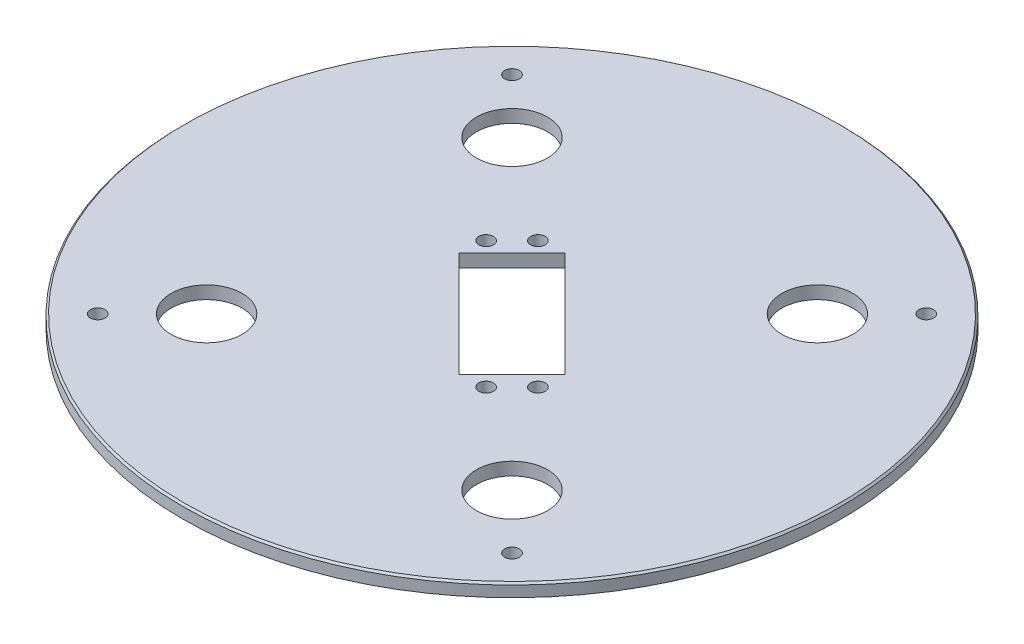
ISO-10303-21;
HEADER;
FILE_DESCRIPTION(('STEP AP214'),'2;1');
FILE_NAME('part.step','',(''),(''),'','','');
FILE_SCHEMA(('AUTOMOTIVE_DESIGN { 1 0 10303 214 1 1 1 1 }'));
ENDSEC;
DATA;
#1=APPLICATION_CONTEXT('core data for automotive mechanical design processes');
#2=APPLICATION_PROTOCOL_DEFINITION('international standard','automotive_design',2000,#1);
#3=PRODUCT_CONTEXT('',#1,'mechanical');
#4=PRODUCT('Part','Part','',(#3));
#5=PRODUCT_RELATED_PRODUCT_CATEGORY('part','',(#4));
#6=PRODUCT_DEFINITION_FORMATION('','',#4);
#7=PRODUCT_DEFINITION_CONTEXT('part definition',#1,'design');
#8=PRODUCT_DEFINITION('design','',#6,#7);
#9=PRODUCT_DEFINITION_SHAPE('','',#8);
#10=(LENGTH_UNIT() NAMED_UNIT(*) SI_UNIT(.MILLI.,.METRE.));
#11=(NAMED_UNIT(*) PLANE_ANGLE_UNIT() SI_UNIT($,.RADIAN.));
#12=(NAMED_UNIT(*) SI_UNIT($,.STERADIAN.) SOLID_ANGLE_UNIT());
#13=UNCERTAINTY_MEASURE_WITH_UNIT(LENGTH_MEASURE(1.E-05),#10,'distance_accuracy_value','');
#14=(GEOMETRIC_REPRESENTATION_CONTEXT(3) GLOBAL_UNCERTAINTY_ASSIGNED_CONTEXT((#13)) GLOBAL_UNIT_ASSIGNED_CONTEXT((#10,
#11,#12)) REPRESENTATION_CONTEXT('',''));
#15=CARTESIAN_POINT('',(0.,0.,0.));
#16=DIRECTION('',(0.,0.,1.));
#17=DIRECTION('',(1.,0.,0.));
#18=AXIS2_PLACEMENT_3D('',#15,#16,#17);
#19=CARTESIAN_POINT('',(0.,3.5,0.));
#20=DIRECTION('',(0.,1.,0.));
#21=DIRECTION('',(0.,0.,1.));
#22=AXIS2_PLACEMENT_3D('',#19,#20,#21);
#23=PLANE('',#22);
#24=CARTESIAN_POINT('',(0.,3.5,0.));
#25=DIRECTION('',(0.,1.,0.));
#26=DIRECTION('',(0.,0.,1.));
#27=AXIS2_PLACEMENT_3D('',#24,#25,#26);
#28=CIRCLE('',#27,89.5);
#29=CARTESIAN_POINT('',(0.,3.5,89.5));
#30=VERTEX_POINT('',#29);
#31=EDGE_CURVE('E40',#30,#30,#28,.T.);
#32=ORIENTED_EDGE('',*,*,#31,.T.);
#33=EDGE_LOOP('',(#32));
#34=FACE_BOUND('',#33,.T.);
#35=CARTESIAN_POINT('',(13.7885822331377,3.5,20.8596500450032));
#36=DIRECTION('',(0.,1.,0.));
#37=DIRECTION('',(0.,0.,1.));
#38=AXIS2_PLACEMENT_3D('',#35,#36,#37);
#39=CIRCLE('',#38,1.99999999999999);
#40=CARTESIAN_POINT('',(13.7885822331377,3.5,22.8596500450031));
#41=VERTEX_POINT('',#40);
#42=EDGE_CURVE('E222',#41,#41,#39,.T.);
#43=ORIENTED_EDGE('',*,*,#42,.F.);
#44=EDGE_LOOP('',(#43));
#45=FACE_BOUND('',#44,.T.);
#46=CARTESIAN_POINT('',(-13.7885822331377,3.5,-20.8596500450032));
#47=DIRECTION('',(0.,1.,0.));
#48=DIRECTION('',(0.,0.,1.));
#49=AXIS2_PLACEMENT_3D('',#46,#47,#48);
#50=CIRCLE('',#49,2.);
#51=CARTESIAN_POINT('',(-13.7885822331377,3.5,-18.8596500450032));
#52=VERTEX_POINT('',#51);
#53=EDGE_CURVE('E102',#52,#52,#50,.T.);
#54=ORIENTED_EDGE('',*,*,#53,.F.);
#55=EDGE_LOOP('',(#54));
#56=FACE_BOUND('',#55,.T.);
#57=CARTESIAN_POINT('',(56.5685424949238,3.5,56.5685424949238));
#58=DIRECTION('',(0.,1.,0.));
#59=DIRECTION('',(0.,0.,1.));
#60=AXIS2_PLACEMENT_3D('',#57,#58,#59);
#61=CIRCLE('',#60,2.);
#62=CARTESIAN_POINT('',(56.5685424949238,3.5,58.5685424949238));
#63=VERTEX_POINT('',#62);
#64=EDGE_CURVE('E112',#63,#63,#61,.T.);
#65=ORIENTED_EDGE('',*,*,#64,.F.);
#66=EDGE_LOOP('',(#65));
#67=FACE_BOUND('',#66,.T.);
#68=CARTESIAN_POINT('',(-56.5685424949238,3.5,56.5685424949238));
#69=DIRECTION('',(0.,1.,0.));
#70=DIRECTION('',(0.,0.,-1.));
#71=AXIS2_PLACEMENT_3D('',#68,#69,#70);
#72=CIRCLE('',#71,2.);
#73=CARTESIAN_POINT('',(-56.5685424949238,3.5,54.5685424949238));
#74=VERTEX_POINT('',#73);
#75=EDGE_CURVE('E124',#74,#74,#72,.T.);
#76=ORIENTED_EDGE('',*,*,#75,.F.);
#77=EDGE_LOOP('',(#76));
#78=FACE_BOUND('',#77,.T.);
#79=CARTESIAN_POINT('',(-41.7,3.5,41.7));
#80=DIRECTION('',(0.,1.,0.));
#81=DIRECTION('',(0.,0.,-1.));
#82=AXIS2_PLACEMENT_3D('',#79,#80,#81);
#83=CIRCLE('',#82,9.7);
#84=CARTESIAN_POINT('',(-41.7,3.5,32.));
#85=VERTEX_POINT('',#84);
#86=EDGE_CURVE('E136',#85,#85,#83,.T.);
#87=ORIENTED_EDGE('',*,*,#86,.F.);
#88=EDGE_LOOP('',(#87));
#89=FACE_BOUND('',#88,.T.);
#90=CARTESIAN_POINT('',(41.7,3.5,-41.7));
#91=DIRECTION('',(0.,1.,0.));
#92=DIRECTION('',(0.,0.,-1.));
#93=AXIS2_PLACEMENT_3D('',#90,#91,#92);
#94=CIRCLE('',#93,9.7);
#95=CARTESIAN_POINT('',(41.7,3.5,-51.4));
#96=VERTEX_POINT('',#95);
#97=EDGE_CURVE('E148',#96,#96,#94,.T.);
#98=ORIENTED_EDGE('',*,*,#97,.F.);
#99=EDGE_LOOP('',(#98));
#100=FACE_BOUND('',#99,.T.);
#101=CARTESIAN_POINT('',(-41.7,3.5,-41.7));
#102=DIRECTION('',(0.,1.,0.));
#103=DIRECTION('',(0.,0.,1.));
#104=AXIS2_PLACEMENT_3D('',#101,#102,#103);
#105=CIRCLE('',#104,9.7);
#106=CARTESIAN_POINT('',(-41.7,3.5,-32.));
#107=VERTEX_POINT('',#106);
#108=EDGE_CURVE('E154',#107,#107,#105,.T.);
#109=ORIENTED_EDGE('',*,*,#108,.F.);
#110=EDGE_LOOP('',(#109));
#111=FACE_BOUND('',#110,.T.);
#112=CARTESIAN_POINT('',(41.7,3.5,41.7));
#113=DIRECTION('',(0.,1.,0.));
#114=DIRECTION('',(0.,0.,1.));
#115=AXIS2_PLACEMENT_3D('',#112,#113,#114);
#116=CIRCLE('',#115,9.7);
#117=CARTESIAN_POINT('',(41.7,3.5,51.4));
#118=VERTEX_POINT('',#117);
#119=EDGE_CURVE('E142',#118,#118,#116,.T.);
#120=ORIENTED_EDGE('',*,*,#119,.F.);
#121=EDGE_LOOP('',(#120));
#122=FACE_BOUND('',#121,.T.);
#123=CARTESIAN_POINT('',(-56.5685424949238,3.5,-56.5685424949238));
#124=DIRECTION('',(0.,1.,0.));
#125=DIRECTION('',(0.,0.,1.));
#126=AXIS2_PLACEMENT_3D('',#123,#124,#125);
#127=CIRCLE('',#126,2.00000000000001);
#128=CARTESIAN_POINT('',(-56.5685424949238,3.5,-54.5685424949238));
#129=VERTEX_POINT('',#128);
#130=EDGE_CURVE('E130',#129,#129,#127,.T.);
#131=ORIENTED_EDGE('',*,*,#130,.F.);
#132=EDGE_LOOP('',(#131));
#133=FACE_BOUND('',#132,.T.);
#134=CARTESIAN_POINT('',(56.5685424949238,3.5,-56.5685424949238));
#135=DIRECTION('',(0.,1.,0.));
#136=DIRECTION('',(0.,0.,-1.));
#137=AXIS2_PLACEMENT_3D('',#134,#135,#136);
#138=CIRCLE('',#137,2.);
#139=CARTESIAN_POINT('',(56.5685424949238,3.5,-58.5685424949238));
#140=VERTEX_POINT('',#139);
#141=EDGE_CURVE('E118',#140,#140,#138,.T.);
#142=ORIENTED_EDGE('',*,*,#141,.F.);
#143=EDGE_LOOP('',(#142));
#144=FACE_BOUND('',#143,.T.);
#145=DIRECTION('',(-0.707106781186548,0.,-0.707106781186547));
#146=VECTOR('',#145,1.);
#147=CARTESIAN_POINT('',(21.6374675043084,3.5,7.14177848998413));
#148=LINE('',#147,#146);
#149=CARTESIAN_POINT('',(21.6374675043084,3.5,7.14177848998413));
#150=VERTEX_POINT('',#149);
#151=CARTESIAN_POINT('',(-7.14177848998413,3.5,-21.6374675043084));
#152=VERTEX_POINT('',#151);
#153=EDGE_CURVE('E81',#150,#152,#148,.T.);
#154=ORIENTED_EDGE('',*,*,#153,.F.);
#155=DIRECTION('',(0.707106781186547,0.,-0.707106781186548));
#156=VECTOR('',#155,1.);
#157=CARTESIAN_POINT('',(7.14177848998414,3.5,21.6374675043084));
#158=LINE('',#157,#156);
#159=CARTESIAN_POINT('',(7.14177848998414,3.5,21.6374675043084));
#160=VERTEX_POINT('',#159);
#161=EDGE_CURVE('E73',#160,#150,#158,.T.);
#162=ORIENTED_EDGE('',*,*,#161,.F.);
#163=DIRECTION('',(0.707106781186548,0.,0.707106781186548));
#164=VECTOR('',#163,1.);
#165=CARTESIAN_POINT('',(7.14177848998414,3.5,21.6374675043084));
#166=LINE('',#165,#164);
#167=CARTESIAN_POINT('',(-21.6374675043084,3.5,-7.14177848998412));
#168=VERTEX_POINT('',#167);
#169=EDGE_CURVE('E96',#168,#160,#166,.T.);
#170=ORIENTED_EDGE('',*,*,#169,.F.);
#171=DIRECTION('',(-0.707106781186547,0.,0.707106781186548));
#172=VECTOR('',#171,1.);
#173=CARTESIAN_POINT('',(-21.6374675043084,3.5,-7.14177848998412));
#174=LINE('',#173,#172);
#175=EDGE_CURVE('E94',#152,#168,#174,.T.);
#176=ORIENTED_EDGE('',*,*,#175,.F.);
#177=EDGE_LOOP('',(#154,#162,#170,#176));
#178=FACE_BOUND('',#177,.T.);
#179=CARTESIAN_POINT('',(20.8596500450032,3.5,13.7885822331377));
#180=DIRECTION('',(0.,1.,0.));
#181=DIRECTION('',(0.,0.,-1.));
#182=AXIS2_PLACEMENT_3D('',#179,#180,#181);
#183=CIRCLE('',#182,1.99999999999999);
#184=CARTESIAN_POINT('',(20.8596500450032,3.5,11.7885822331377));
#185=VERTEX_POINT('',#184);
#186=EDGE_CURVE('E227',#185,#185,#183,.T.);
#187=ORIENTED_EDGE('',*,*,#186,.F.);
#188=EDGE_LOOP('',(#187));
#189=FACE_BOUND('',#188,.T.);
#190=CARTESIAN_POINT('',(-20.8596500450032,3.5,-13.7885822331377));
#191=DIRECTION('',(0.,1.,0.));
#192=DIRECTION('',(0.,0.,-1.));
#193=AXIS2_PLACEMENT_3D('',#190,#191,#192);
#194=CIRCLE('',#193,2.);
#195=CARTESIAN_POINT('',(-20.8596500450032,3.5,-15.7885822331377));
#196=VERTEX_POINT('',#195);
#197=EDGE_CURVE('E216',#196,#196,#194,.T.);
#198=ORIENTED_EDGE('',*,*,#197,.F.);
#199=EDGE_LOOP('',(#198));
#200=FACE_BOUND('',#199,.T.);
#201=ADVANCED_FACE('F32',(#34,#45,#56,#67,#78,#89,#100,#111,#122,#133,#144,#178,#189,#200),#23,.T.);
#202=CARTESIAN_POINT('',(0.,0.,0.));
#203=DIRECTION('',(0.,1.,0.));
#204=DIRECTION('',(0.,0.,1.));
#205=AXIS2_PLACEMENT_3D('',#202,#203,#204);
#206=PLANE('',#205);
#207=CARTESIAN_POINT('',(13.7885822331377,0.,20.8596500450032));
#208=DIRECTION('',(0.,1.,0.));
#209=DIRECTION('',(0.,0.,1.));
#210=AXIS2_PLACEMENT_3D('',#207,#208,#209);
#211=CIRCLE('',#210,1.99999999999999);
#212=CARTESIAN_POINT('',(13.7885822331377,0.,22.8596500450031));
#213=VERTEX_POINT('',#212);
#214=EDGE_CURVE('E219',#213,#213,#211,.T.);
#215=ORIENTED_EDGE('',*,*,#214,.T.);
#216=EDGE_LOOP('',(#215));
#217=FACE_BOUND('',#216,.T.);
#218=CARTESIAN_POINT('',(-13.7885822331377,0.,-20.8596500450032));
#219=DIRECTION('',(0.,1.,0.));
#220=DIRECTION('',(0.,0.,1.));
#221=AXIS2_PLACEMENT_3D('',#218,#219,#220);
#222=CIRCLE('',#221,2.);
#223=CARTESIAN_POINT('',(-13.7885822331377,0.,-18.8596500450032));
#224=VERTEX_POINT('',#223);
#225=EDGE_CURVE('E230',#224,#224,#222,.T.);
#226=ORIENTED_EDGE('',*,*,#225,.T.);
#227=EDGE_LOOP('',(#226));
#228=FACE_BOUND('',#227,.T.);
#229=CARTESIAN_POINT('',(56.5685424949238,0.,56.5685424949238));
#230=DIRECTION('',(0.,1.,0.));
#231=DIRECTION('',(0.,0.,1.));
#232=AXIS2_PLACEMENT_3D('',#229,#230,#231);
#233=CIRCLE('',#232,2.);
#234=CARTESIAN_POINT('',(56.5685424949238,0.,58.5685424949238));
#235=VERTEX_POINT('',#234);
#236=EDGE_CURVE('E89',#235,#235,#233,.T.);
#237=ORIENTED_EDGE('',*,*,#236,.T.);
#238=EDGE_LOOP('',(#237));
#239=FACE_BOUND('',#238,.T.);
#240=CARTESIAN_POINT('',(-56.5685424949238,0.,56.5685424949238));
#241=DIRECTION('',(0.,1.,0.));
#242=DIRECTION('',(0.,0.,-1.));
#243=AXIS2_PLACEMENT_3D('',#240,#241,#242);
#244=CIRCLE('',#243,2.);
#245=CARTESIAN_POINT('',(-56.5685424949238,0.,54.5685424949238));
#246=VERTEX_POINT('',#245);
#247=EDGE_CURVE('E121',#246,#246,#244,.T.);
#248=ORIENTED_EDGE('',*,*,#247,.T.);
#249=EDGE_LOOP('',(#248));
#250=FACE_BOUND('',#249,.T.);
#251=CARTESIAN_POINT('',(-41.7,0.,41.7));
#252=DIRECTION('',(0.,1.,0.));
#253=DIRECTION('',(0.,0.,-1.));
#254=AXIS2_PLACEMENT_3D('',#251,#252,#253);
#255=CIRCLE('',#254,9.7);
#256=CARTESIAN_POINT('',(-41.7,0.,32.));
#257=VERTEX_POINT('',#256);
#258=EDGE_CURVE('E133',#257,#257,#255,.T.);
#259=ORIENTED_EDGE('',*,*,#258,.T.);
#260=EDGE_LOOP('',(#259));
#261=FACE_BOUND('',#260,.T.);
#262=CARTESIAN_POINT('',(41.7,0.,-41.7));
#263=DIRECTION('',(0.,1.,0.));
#264=DIRECTION('',(0.,0.,-1.));
#265=AXIS2_PLACEMENT_3D('',#262,#263,#264);
#266=CIRCLE('',#265,9.7);
#267=CARTESIAN_POINT('',(41.7,0.,-51.4));
#268=VERTEX_POINT('',#267);
#269=EDGE_CURVE('E145',#268,#268,#266,.T.);
#270=ORIENTED_EDGE('',*,*,#269,.T.);
#271=EDGE_LOOP('',(#270));
#272=FACE_BOUND('',#271,.T.);
#273=CARTESIAN_POINT('',(0.,0.,0.));
#274=DIRECTION('',(0.,1.,0.));
#275=DIRECTION('',(0.,0.,1.));
#276=AXIS2_PLACEMENT_3D('',#273,#274,#275);
#277=CIRCLE('',#276,90.);
#278=CARTESIAN_POINT('',(0.,0.,90.));
#279=VERTEX_POINT('',#278);
#280=EDGE_CURVE('E157',#279,#279,#277,.T.);
#281=ORIENTED_EDGE('',*,*,#280,.F.);
#282=EDGE_LOOP('',(#281));
#283=FACE_BOUND('',#282,.T.);
#284=CARTESIAN_POINT('',(-41.7,0.,-41.7));
#285=DIRECTION('',(0.,1.,0.));
#286=DIRECTION('',(0.,0.,1.));
#287=AXIS2_PLACEMENT_3D('',#284,#285,#286);
#288=CIRCLE('',#287,9.7);
#289=CARTESIAN_POINT('',(-41.7,0.,-32.));
#290=VERTEX_POINT('',#289);
#291=EDGE_CURVE('E151',#290,#290,#288,.T.);
#292=ORIENTED_EDGE('',*,*,#291,.T.);
#293=EDGE_LOOP('',(#292));
#294=FACE_BOUND('',#293,.T.);
#295=CARTESIAN_POINT('',(41.7,0.,41.7));
#296=DIRECTION('',(0.,1.,0.));
#297=DIRECTION('',(0.,0.,1.));
#298=AXIS2_PLACEMENT_3D('',#295,#296,#297);
#299=CIRCLE('',#298,9.7);
#300=CARTESIAN_POINT('',(41.7,0.,51.4));
#301=VERTEX_POINT('',#300);
#302=EDGE_CURVE('E139',#301,#301,#299,.T.);
#303=ORIENTED_EDGE('',*,*,#302,.T.);
#304=EDGE_LOOP('',(#303));
#305=FACE_BOUND('',#304,.T.);
#306=CARTESIAN_POINT('',(-56.5685424949238,0.,-56.5685424949238));
#307=DIRECTION('',(0.,1.,0.));
#308=DIRECTION('',(0.,0.,1.));
#309=AXIS2_PLACEMENT_3D('',#306,#307,#308);
#310=CIRCLE('',#309,2.00000000000001);
#311=CARTESIAN_POINT('',(-56.5685424949238,0.,-54.5685424949238));
#312=VERTEX_POINT('',#311);
#313=EDGE_CURVE('E127',#312,#312,#310,.T.);
#314=ORIENTED_EDGE('',*,*,#313,.T.);
#315=EDGE_LOOP('',(#314));
#316=FACE_BOUND('',#315,.T.);
#317=CARTESIAN_POINT('',(56.5685424949238,0.,-56.5685424949238));
#318=DIRECTION('',(0.,1.,0.));
#319=DIRECTION('',(0.,0.,-1.));
#320=AXIS2_PLACEMENT_3D('',#317,#318,#319);
#321=CIRCLE('',#320,2.);
#322=CARTESIAN_POINT('',(56.5685424949238,0.,-58.5685424949238));
#323=VERTEX_POINT('',#322);
#324=EDGE_CURVE('E115',#323,#323,#321,.T.);
#325=ORIENTED_EDGE('',*,*,#324,.T.);
#326=EDGE_LOOP('',(#325));
#327=FACE_BOUND('',#326,.T.);
#328=DIRECTION('',(0.707106781186547,0.,-0.707106781186548));
#329=VECTOR('',#328,1.);
#330=CARTESIAN_POINT('',(7.14177848998414,0.,21.6374675043084));
#331=LINE('',#330,#329);
#332=CARTESIAN_POINT('',(7.14177848998414,0.,21.6374675043084));
#333=VERTEX_POINT('',#332);
#334=CARTESIAN_POINT('',(21.6374675043084,0.,7.14177848998413));
#335=VERTEX_POINT('',#334);
#336=EDGE_CURVE('E55',#333,#335,#331,.T.);
#337=ORIENTED_EDGE('',*,*,#336,.T.);
#338=DIRECTION('',(-0.707106781186548,0.,-0.707106781186547));
#339=VECTOR('',#338,1.);
#340=CARTESIAN_POINT('',(21.6374675043084,0.,7.14177848998413));
#341=LINE('',#340,#339);
#342=CARTESIAN_POINT('',(-7.14177848998413,0.,-21.6374675043084));
#343=VERTEX_POINT('',#342);
#344=EDGE_CURVE('E88',#335,#343,#341,.T.);
#345=ORIENTED_EDGE('',*,*,#344,.T.);
#346=DIRECTION('',(-0.707106781186547,0.,0.707106781186548));
#347=VECTOR('',#346,1.);
#348=CARTESIAN_POINT('',(-21.6374675043084,0.,-7.14177848998412));
#349=LINE('',#348,#347);
#350=CARTESIAN_POINT('',(-21.6374675043084,0.,-7.14177848998412));
#351=VERTEX_POINT('',#350);
#352=EDGE_CURVE('E104',#343,#351,#349,.T.);
#353=ORIENTED_EDGE('',*,*,#352,.T.);
#354=DIRECTION('',(0.707106781186548,0.,0.707106781186548));
#355=VECTOR('',#354,1.);
#356=CARTESIAN_POINT('',(7.14177848998414,0.,21.6374675043084));
#357=LINE('',#356,#355);
#358=EDGE_CURVE('E82',#351,#333,#357,.T.);
#359=ORIENTED_EDGE('',*,*,#358,.T.);
#360=EDGE_LOOP('',(#337,#345,#353,#359));
#361=FACE_BOUND('',#360,.T.);
#362=CARTESIAN_POINT('',(20.8596500450032,0.,13.7885822331377));
#363=DIRECTION('',(0.,1.,0.));
#364=DIRECTION('',(0.,0.,-1.));
#365=AXIS2_PLACEMENT_3D('',#362,#363,#364);
#366=CIRCLE('',#365,1.99999999999999);
#367=CARTESIAN_POINT('',(20.8596500450032,0.,11.7885822331377));
#368=VERTEX_POINT('',#367);
#369=EDGE_CURVE('E211',#368,#368,#366,.T.);
#370=ORIENTED_EDGE('',*,*,#369,.T.);
#371=EDGE_LOOP('',(#370));
#372=FACE_BOUND('',#371,.T.);
#373=CARTESIAN_POINT('',(-20.8596500450032,0.,-13.7885822331377));
#374=DIRECTION('',(0.,1.,0.));
#375=DIRECTION('',(0.,0.,-1.));
#376=AXIS2_PLACEMENT_3D('',#373,#374,#375);
#377=CIRCLE('',#376,2.);
#378=CARTESIAN_POINT('',(-20.8596500450032,0.,-15.7885822331377));
#379=VERTEX_POINT('',#378);
#380=EDGE_CURVE('E214',#379,#379,#377,.T.);
#381=ORIENTED_EDGE('',*,*,#380,.T.);
#382=EDGE_LOOP('',(#381));
#383=FACE_BOUND('',#382,.T.);
#384=ADVANCED_FACE('F177',(#217,#228,#239,#250,#261,#272,#283,#294,#305,#316,#327,#361,#372,
#383),#206,.F.);
#385=CARTESIAN_POINT('',(0.,3.5,0.));
#386=DIRECTION('',(0.,-1.,0.));
#387=DIRECTION('',(0.,0.,-1.));
#388=AXIS2_PLACEMENT_3D('',#385,#386,#387);
#389=CYLINDRICAL_SURFACE('',#388,90.);
#390=CARTESIAN_POINT('',(0.,2.99999999999999,0.));
#391=DIRECTION('',(0.,1.,0.));
#392=DIRECTION('',(0.,0.,1.));
#393=AXIS2_PLACEMENT_3D('',#390,#391,#392);
#394=CIRCLE('',#393,90.);
#395=CARTESIAN_POINT('',(0.,2.99999999999999,90.));
#396=VERTEX_POINT('',#395);
#397=EDGE_CURVE('E11',#396,#396,#394,.F.);
#398=ORIENTED_EDGE('',*,*,#397,.T.);
#399=EDGE_LOOP('',(#398));
#400=FACE_BOUND('',#399,.T.);
#401=ORIENTED_EDGE('',*,*,#280,.T.);
#402=EDGE_LOOP('',(#401));
#403=FACE_BOUND('',#402,.T.);
#404=ADVANCED_FACE('F182',(#400,#403),#389,.T.);
#405=CARTESIAN_POINT('',(-41.7,3.5,-41.7));
#406=DIRECTION('',(0.,-1.,0.));
#407=DIRECTION('',(0.,0.,-1.));
#408=AXIS2_PLACEMENT_3D('',#405,#406,#407);
#409=CYLINDRICAL_SURFACE('',#408,9.7);
#410=ORIENTED_EDGE('',*,*,#108,.T.);
#411=EDGE_LOOP('',(#410));
#412=FACE_BOUND('',#411,.T.);
#413=ORIENTED_EDGE('',*,*,#291,.F.);
#414=EDGE_LOOP('',(#413));
#415=FACE_BOUND('',#414,.T.);
#416=ADVANCED_FACE('F186',(#412,#415),#409,.F.);
#417=CARTESIAN_POINT('',(41.7,3.5,-41.7));
#418=DIRECTION('',(0.,-1.,0.));
#419=DIRECTION('',(0.,0.,-1.));
#420=AXIS2_PLACEMENT_3D('',#417,#418,#419);
#421=CYLINDRICAL_SURFACE('',#420,9.7);
#422=ORIENTED_EDGE('',*,*,#97,.T.);
#423=EDGE_LOOP('',(#422));
#424=FACE_BOUND('',#423,.T.);
#425=ORIENTED_EDGE('',*,*,#269,.F.);
#426=EDGE_LOOP('',(#425));
#427=FACE_BOUND('',#426,.T.);
#428=ADVANCED_FACE('F193',(#424,#427),#421,.F.);
#429=CARTESIAN_POINT('',(41.7,3.5,41.7));
#430=DIRECTION('',(0.,-1.,0.));
#431=DIRECTION('',(0.,0.,-1.));
#432=AXIS2_PLACEMENT_3D('',#429,#430,#431);
#433=CYLINDRICAL_SURFACE('',#432,9.7);
#434=ORIENTED_EDGE('',*,*,#119,.T.);
#435=EDGE_LOOP('',(#434));
#436=FACE_BOUND('',#435,.T.);
#437=ORIENTED_EDGE('',*,*,#302,.F.);
#438=EDGE_LOOP('',(#437));
#439=FACE_BOUND('',#438,.T.);
#440=ADVANCED_FACE('F280',(#436,#439),#433,.F.);
#441=CARTESIAN_POINT('',(-41.7,3.5,41.7));
#442=DIRECTION('',(0.,-1.,0.));
#443=DIRECTION('',(0.,0.,-1.));
#444=AXIS2_PLACEMENT_3D('',#441,#442,#443);
#445=CYLINDRICAL_SURFACE('',#444,9.7);
#446=ORIENTED_EDGE('',*,*,#86,.T.);
#447=EDGE_LOOP('',(#446));
#448=FACE_BOUND('',#447,.T.);
#449=ORIENTED_EDGE('',*,*,#258,.F.);
#450=EDGE_LOOP('',(#449));
#451=FACE_BOUND('',#450,.T.);
#452=ADVANCED_FACE('F276',(#448,#451),#445,.F.);
#453=CARTESIAN_POINT('',(-56.5685424949238,3.5,-56.5685424949238));
#454=DIRECTION('',(0.,-1.,0.));
#455=DIRECTION('',(0.,0.,-1.));
#456=AXIS2_PLACEMENT_3D('',#453,#454,#455);
#457=CYLINDRICAL_SURFACE('',#456,2.00000000000001);
#458=ORIENTED_EDGE('',*,*,#130,.T.);
#459=EDGE_LOOP('',(#458));
#460=FACE_BOUND('',#459,.T.);
#461=ORIENTED_EDGE('',*,*,#313,.F.);
#462=EDGE_LOOP('',(#461));
#463=FACE_BOUND('',#462,.T.);
#464=ADVANCED_FACE('F272',(#460,#463),#457,.F.);
#465=CARTESIAN_POINT('',(-56.5685424949238,3.5,56.5685424949238));
#466=DIRECTION('',(0.,-1.,0.));
#467=DIRECTION('',(0.,0.,-1.));
#468=AXIS2_PLACEMENT_3D('',#465,#466,#467);
#469=CYLINDRICAL_SURFACE('',#468,2.);
#470=ORIENTED_EDGE('',*,*,#75,.T.);
#471=EDGE_LOOP('',(#470));
#472=FACE_BOUND('',#471,.T.);
#473=ORIENTED_EDGE('',*,*,#247,.F.);
#474=EDGE_LOOP('',(#473));
#475=FACE_BOUND('',#474,.T.);
#476=ADVANCED_FACE('F268',(#472,#475),#469,.F.);
#477=CARTESIAN_POINT('',(56.5685424949238,3.5,-56.5685424949238));
#478=DIRECTION('',(0.,-1.,0.));
#479=DIRECTION('',(0.,0.,-1.));
#480=AXIS2_PLACEMENT_3D('',#477,#478,#479);
#481=CYLINDRICAL_SURFACE('',#480,2.);
#482=ORIENTED_EDGE('',*,*,#141,.T.);
#483=EDGE_LOOP('',(#482));
#484=FACE_BOUND('',#483,.T.);
#485=ORIENTED_EDGE('',*,*,#324,.F.);
#486=EDGE_LOOP('',(#485));
#487=FACE_BOUND('',#486,.T.);
#488=ADVANCED_FACE('F264',(#484,#487),#481,.F.);
#489=CARTESIAN_POINT('',(56.5685424949238,3.5,56.5685424949238));
#490=DIRECTION('',(0.,-1.,0.));
#491=DIRECTION('',(0.,0.,-1.));
#492=AXIS2_PLACEMENT_3D('',#489,#490,#491);
#493=CYLINDRICAL_SURFACE('',#492,2.);
#494=ORIENTED_EDGE('',*,*,#64,.T.);
#495=EDGE_LOOP('',(#494));
#496=FACE_BOUND('',#495,.T.);
#497=ORIENTED_EDGE('',*,*,#236,.F.);
#498=EDGE_LOOP('',(#497));
#499=FACE_BOUND('',#498,.T.);
#500=ADVANCED_FACE('F261',(#496,#499),#493,.F.);
#501=CARTESIAN_POINT('',(7.14177848998414,3.5,21.6374675043084));
#502=DIRECTION('',(-0.707106781186548,0.,-0.707106781186547));
#503=DIRECTION('',(-0.707106781186547,0.,0.707106781186548));
#504=AXIS2_PLACEMENT_3D('',#501,#502,#503);
#505=PLANE('',#504);
#506=ORIENTED_EDGE('',*,*,#336,.F.);
#507=DIRECTION('',(0.,-1.,0.));
#508=VECTOR('',#507,1.);
#509=CARTESIAN_POINT('',(7.14177848998414,3.5,21.6374675043084));
#510=LINE('',#509,#508);
#511=EDGE_CURVE('E77',#160,#333,#510,.T.);
#512=ORIENTED_EDGE('',*,*,#511,.F.);
#513=ORIENTED_EDGE('',*,*,#161,.T.);
#514=DIRECTION('',(0.,-1.,0.));
#515=VECTOR('',#514,1.);
#516=CARTESIAN_POINT('',(21.6374675043084,3.5,7.14177848998413));
#517=LINE('',#516,#515);
#518=EDGE_CURVE('E76',#150,#335,#517,.T.);
#519=ORIENTED_EDGE('',*,*,#518,.T.);
#520=EDGE_LOOP('',(#506,#512,#513,#519));
#521=FACE_BOUND('',#520,.T.);
#522=ADVANCED_FACE('F75',(#521),#505,.T.);
#523=CARTESIAN_POINT('',(21.6374675043084,3.5,7.14177848998413));
#524=DIRECTION('',(-0.707106781186547,0.,0.707106781186548));
#525=DIRECTION('',(0.707106781186548,0.,0.707106781186547));
#526=AXIS2_PLACEMENT_3D('',#523,#524,#525);
#527=PLANE('',#526);
#528=ORIENTED_EDGE('',*,*,#344,.F.);
#529=ORIENTED_EDGE('',*,*,#518,.F.);
#530=ORIENTED_EDGE('',*,*,#153,.T.);
#531=DIRECTION('',(0.,-1.,0.));
#532=VECTOR('',#531,1.);
#533=CARTESIAN_POINT('',(-7.14177848998413,3.5,-21.6374675043084));
#534=LINE('',#533,#532);
#535=EDGE_CURVE('E90',#152,#343,#534,.T.);
#536=ORIENTED_EDGE('',*,*,#535,.T.);
#537=EDGE_LOOP('',(#528,#529,#530,#536));
#538=FACE_BOUND('',#537,.T.);
#539=ADVANCED_FACE('F85',(#538),#527,.T.);
#540=CARTESIAN_POINT('',(-21.6374675043084,3.5,-7.14177848998412));
#541=DIRECTION('',(0.707106781186548,0.,0.707106781186547));
#542=DIRECTION('',(0.707106781186547,0.,-0.707106781186548));
#543=AXIS2_PLACEMENT_3D('',#540,#541,#542);
#544=PLANE('',#543);
#545=ORIENTED_EDGE('',*,*,#352,.F.);
#546=ORIENTED_EDGE('',*,*,#535,.F.);
#547=ORIENTED_EDGE('',*,*,#175,.T.);
#548=DIRECTION('',(0.,-1.,0.));
#549=VECTOR('',#548,1.);
#550=CARTESIAN_POINT('',(-21.6374675043084,3.5,-7.14177848998412));
#551=LINE('',#550,#549);
#552=EDGE_CURVE('E47',#168,#351,#551,.T.);
#553=ORIENTED_EDGE('',*,*,#552,.T.);
#554=EDGE_LOOP('',(#545,#546,#547,#553));
#555=FACE_BOUND('',#554,.T.);
#556=ADVANCED_FACE('F250',(#555),#544,.T.);
#557=CARTESIAN_POINT('',(7.14177848998414,3.5,21.6374675043084));
#558=DIRECTION('',(0.707106781186547,0.,-0.707106781186548));
#559=DIRECTION('',(-0.707106781186548,0.,-0.707106781186547));
#560=AXIS2_PLACEMENT_3D('',#557,#558,#559);
#561=PLANE('',#560);
#562=ORIENTED_EDGE('',*,*,#358,.F.);
#563=ORIENTED_EDGE('',*,*,#552,.F.);
#564=ORIENTED_EDGE('',*,*,#169,.T.);
#565=ORIENTED_EDGE('',*,*,#511,.T.);
#566=EDGE_LOOP('',(#562,#563,#564,#565));
#567=FACE_BOUND('',#566,.T.);
#568=ADVANCED_FACE('F241',(#567),#561,.T.);
#569=CARTESIAN_POINT('',(-13.7885822331377,3.5,-20.8596500450032));
#570=DIRECTION('',(0.,-1.,0.));
#571=DIRECTION('',(0.,0.,-1.));
#572=AXIS2_PLACEMENT_3D('',#569,#570,#571);
#573=CYLINDRICAL_SURFACE('',#572,2.);
#574=ORIENTED_EDGE('',*,*,#53,.T.);
#575=EDGE_LOOP('',(#574));
#576=FACE_BOUND('',#575,.T.);
#577=ORIENTED_EDGE('',*,*,#225,.F.);
#578=EDGE_LOOP('',(#577));
#579=FACE_BOUND('',#578,.T.);
#580=ADVANCED_FACE('F238',(#576,#579),#573,.F.);
#581=CARTESIAN_POINT('',(20.8596500450032,3.5,13.7885822331377));
#582=DIRECTION('',(0.,-1.,0.));
#583=DIRECTION('',(0.,0.,-1.));
#584=AXIS2_PLACEMENT_3D('',#581,#582,#583);
#585=CYLINDRICAL_SURFACE('',#584,1.99999999999999);
#586=ORIENTED_EDGE('',*,*,#186,.T.);
#587=EDGE_LOOP('',(#586));
#588=FACE_BOUND('',#587,.T.);
#589=ORIENTED_EDGE('',*,*,#369,.F.);
#590=EDGE_LOOP('',(#589));
#591=FACE_BOUND('',#590,.T.);
#592=ADVANCED_FACE('F240',(#588,#591),#585,.F.);
#593=CARTESIAN_POINT('',(13.7885822331377,3.5,20.8596500450032));
#594=DIRECTION('',(0.,-1.,0.));
#595=DIRECTION('',(0.,0.,-1.));
#596=AXIS2_PLACEMENT_3D('',#593,#594,#595);
#597=CYLINDRICAL_SURFACE('',#596,1.99999999999999);
#598=ORIENTED_EDGE('',*,*,#42,.T.);
#599=EDGE_LOOP('',(#598));
#600=FACE_BOUND('',#599,.T.);
#601=ORIENTED_EDGE('',*,*,#214,.F.);
#602=EDGE_LOOP('',(#601));
#603=FACE_BOUND('',#602,.T.);
#604=ADVANCED_FACE('F172',(#600,#603),#597,.F.);
#605=CARTESIAN_POINT('',(-20.8596500450032,3.5,-13.7885822331377));
#606=DIRECTION('',(0.,-1.,0.));
#607=DIRECTION('',(0.,0.,-1.));
#608=AXIS2_PLACEMENT_3D('',#605,#606,#607);
#609=CYLINDRICAL_SURFACE('',#608,2.);
#610=ORIENTED_EDGE('',*,*,#197,.T.);
#611=EDGE_LOOP('',(#610));
#612=FACE_BOUND('',#611,.T.);
#613=ORIENTED_EDGE('',*,*,#380,.F.);
#614=EDGE_LOOP('',(#613));
#615=FACE_BOUND('',#614,.T.);
#616=ADVANCED_FACE('F167',(#612,#615),#609,.F.);
#617=CARTESIAN_POINT('',(0.,3.5,0.));
#618=DIRECTION('',(0.,-1.,0.));
#619=DIRECTION('',(0.,0.,-1.));
#620=AXIS2_PLACEMENT_3D('',#617,#618,#619);
#621=CONICAL_SURFACE('',#620,89.5,0.785398163397448);
#622=ORIENTED_EDGE('',*,*,#397,.F.);
#623=EDGE_LOOP('',(#622));
#624=FACE_BOUND('',#623,.T.);
#625=ORIENTED_EDGE('',*,*,#31,.F.);
#626=EDGE_LOOP('',(#625));
#627=FACE_BOUND('',#626,.T.);
#628=ADVANCED_FACE('F34',(#624,#627),#621,.T.);
#629=CLOSED_SHELL('',(#201,#384,#404,#416,#428,#440,#452,#464,#476,#488,#500,#522,#539,#556,
#568,#580,#592,#604,#616,#628));
#630=MANIFOLD_SOLID_BREP('B2',#629);
#631=ADVANCED_BREP_SHAPE_REPRESENTATION('',(#18,#630),#14);
#632=SHAPE_DEFINITION_REPRESENTATION(#9,#631);
ENDSEC;
END-ISO-10303-21;
